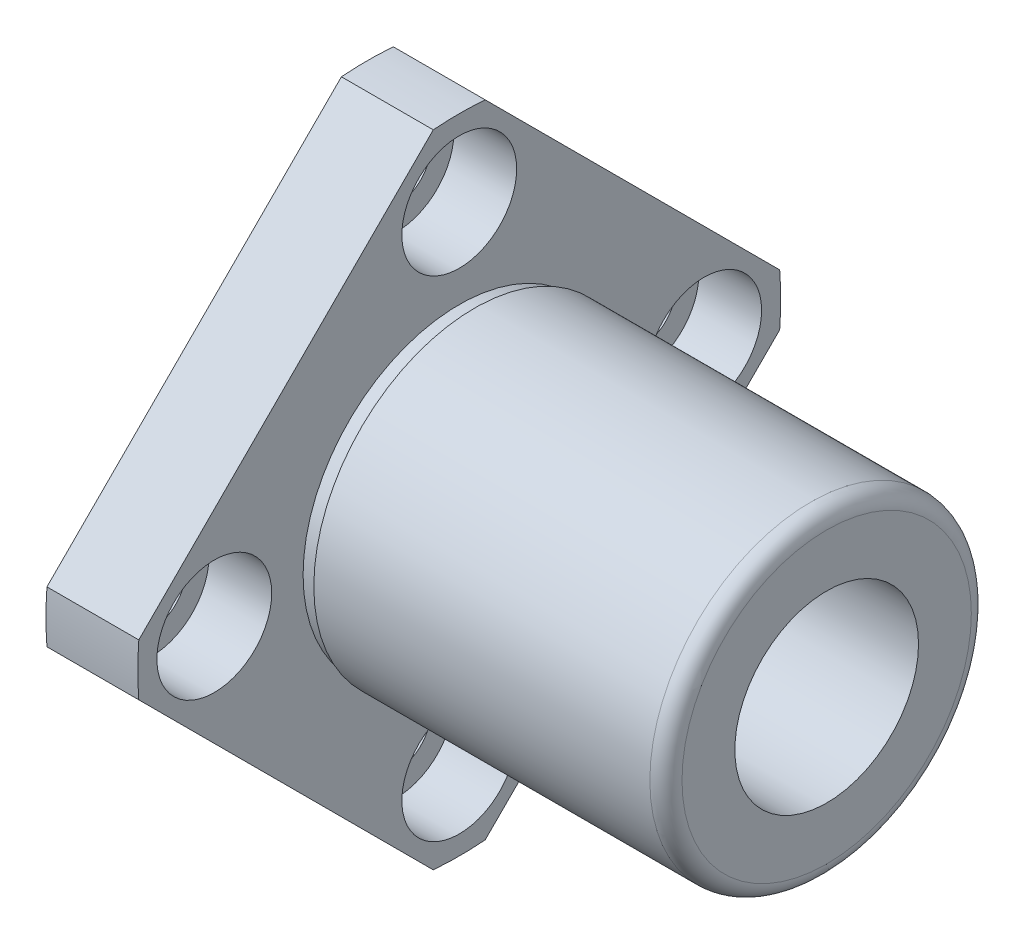
ISO-10303-21;
HEADER;
FILE_DESCRIPTION(('STEP AP214'),'2;1');
FILE_NAME('part.step','',(''),(''),'','','');
FILE_SCHEMA(('AUTOMOTIVE_DESIGN { 1 0 10303 214 1 1 1 1 }'));
ENDSEC;
DATA;
#1=APPLICATION_CONTEXT('core data for automotive mechanical design processes');
#2=APPLICATION_PROTOCOL_DEFINITION('international standard','automotive_design',2000,#1);
#3=PRODUCT_CONTEXT('',#1,'mechanical');
#4=PRODUCT('Part','Part','',(#3));
#5=PRODUCT_RELATED_PRODUCT_CATEGORY('part','',(#4));
#6=PRODUCT_DEFINITION_FORMATION('','',#4);
#7=PRODUCT_DEFINITION_CONTEXT('part definition',#1,'design');
#8=PRODUCT_DEFINITION('design','',#6,#7);
#9=PRODUCT_DEFINITION_SHAPE('','',#8);
#10=(LENGTH_UNIT() NAMED_UNIT(*) SI_UNIT(.MILLI.,.METRE.));
#11=(NAMED_UNIT(*) PLANE_ANGLE_UNIT() SI_UNIT($,.RADIAN.));
#12=(NAMED_UNIT(*) SI_UNIT($,.STERADIAN.) SOLID_ANGLE_UNIT());
#13=UNCERTAINTY_MEASURE_WITH_UNIT(LENGTH_MEASURE(1.E-05),#10,'distance_accuracy_value','');
#14=(GEOMETRIC_REPRESENTATION_CONTEXT(3) GLOBAL_UNCERTAINTY_ASSIGNED_CONTEXT((#13)) GLOBAL_UNIT_ASSIGNED_CONTEXT((#10,
#11,#12)) REPRESENTATION_CONTEXT('',''));
#15=CARTESIAN_POINT('',(0.,0.,0.));
#16=DIRECTION('',(0.,0.,1.));
#17=DIRECTION('',(1.,0.,0.));
#18=AXIS2_PLACEMENT_3D('',#15,#16,#17);
#19=CARTESIAN_POINT('',(0.,0.,0.));
#20=DIRECTION('',(-1.,0.,0.));
#21=DIRECTION('',(0.,0.,1.));
#22=AXIS2_PLACEMENT_3D('',#19,#20,#21);
#23=PLANE('',#22);
#24=CARTESIAN_POINT('',(0.,0.,0.));
#25=DIRECTION('',(1.,0.,0.));
#26=DIRECTION('',(0.,0.,-1.));
#27=AXIS2_PLACEMENT_3D('',#24,#25,#26);
#28=CIRCLE('',#27,5.99999999999998);
#29=CARTESIAN_POINT('',(0.,0.,-5.99999999999998));
#30=VERTEX_POINT('',#29);
#31=EDGE_CURVE('E257',#30,#30,#28,.T.);
#32=ORIENTED_EDGE('',*,*,#31,.T.);
#33=EDGE_LOOP('',(#32));
#34=FACE_BOUND('',#33,.T.);
#35=CARTESIAN_POINT('',(0.,-16.,0.));
#36=DIRECTION('',(1.,0.,0.));
#37=DIRECTION('',(0.,0.,-1.));
#38=AXIS2_PLACEMENT_3D('',#35,#36,#37);
#39=CIRCLE('',#38,2.25000000000001);
#40=CARTESIAN_POINT('',(0.,-16.,-2.25000000000001));
#41=VERTEX_POINT('',#40);
#42=EDGE_CURVE('E273',#41,#41,#39,.T.);
#43=ORIENTED_EDGE('',*,*,#42,.T.);
#44=EDGE_LOOP('',(#43));
#45=FACE_BOUND('',#44,.T.);
#46=CARTESIAN_POINT('',(0.,0.,-16.));
#47=DIRECTION('',(1.,0.,0.));
#48=DIRECTION('',(0.,0.,-1.));
#49=AXIS2_PLACEMENT_3D('',#46,#47,#48);
#50=CIRCLE('',#49,2.25000000000001);
#51=CARTESIAN_POINT('',(0.,0.,-18.25));
#52=VERTEX_POINT('',#51);
#53=EDGE_CURVE('E285',#52,#52,#50,.T.);
#54=ORIENTED_EDGE('',*,*,#53,.T.);
#55=EDGE_LOOP('',(#54));
#56=FACE_BOUND('',#55,.T.);
#57=CARTESIAN_POINT('',(0.,0.,16.));
#58=DIRECTION('',(1.,0.,0.));
#59=DIRECTION('',(0.,0.,-1.));
#60=AXIS2_PLACEMENT_3D('',#57,#58,#59);
#61=CIRCLE('',#60,2.25000000000001);
#62=CARTESIAN_POINT('',(0.,0.,13.75));
#63=VERTEX_POINT('',#62);
#64=EDGE_CURVE('E297',#63,#63,#61,.T.);
#65=ORIENTED_EDGE('',*,*,#64,.T.);
#66=EDGE_LOOP('',(#65));
#67=FACE_BOUND('',#66,.T.);
#68=CARTESIAN_POINT('',(0.,0.,0.));
#69=DIRECTION('',(-1.,0.,0.));
#70=DIRECTION('',(0.,0.,1.));
#71=AXIS2_PLACEMENT_3D('',#68,#69,#70);
#72=CIRCLE('',#71,21.);
#73=CARTESIAN_POINT('',(0.,-1.69601646814907,20.9314005298204));
#74=VERTEX_POINT('',#73);
#75=CARTESIAN_POINT('',(0.,1.69601646814907,20.9314005298204));
#76=VERTEX_POINT('',#75);
#77=EDGE_CURVE('E130',#74,#76,#72,.T.);
#78=ORIENTED_EDGE('',*,*,#77,.T.);
#79=DIRECTION('',(0.,0.707106781186547,-0.707106781186547));
#80=VECTOR('',#79,1.);
#81=CARTESIAN_POINT('',(0.,1.69601646814907,20.9314005298204));
#82=LINE('',#81,#80);
#83=CARTESIAN_POINT('',(0.,20.9314005298204,1.69601646814907));
#84=VERTEX_POINT('',#83);
#85=EDGE_CURVE('E133',#76,#84,#82,.T.);
#86=ORIENTED_EDGE('',*,*,#85,.T.);
#87=CARTESIAN_POINT('',(0.,0.,0.));
#88=DIRECTION('',(-1.,0.,0.));
#89=DIRECTION('',(0.,0.,1.));
#90=AXIS2_PLACEMENT_3D('',#87,#88,#89);
#91=CIRCLE('',#90,21.);
#92=CARTESIAN_POINT('',(0.,20.9314005298204,-1.69601646814907));
#93=VERTEX_POINT('',#92);
#94=EDGE_CURVE('E137',#84,#93,#91,.T.);
#95=ORIENTED_EDGE('',*,*,#94,.T.);
#96=DIRECTION('',(0.,-0.707106781186548,-0.707106781186547));
#97=VECTOR('',#96,1.);
#98=CARTESIAN_POINT('',(0.,20.9314005298204,-1.69601646814907));
#99=LINE('',#98,#97);
#100=CARTESIAN_POINT('',(0.,1.69601646814906,-20.9314005298204));
#101=VERTEX_POINT('',#100);
#102=EDGE_CURVE('E140',#93,#101,#99,.T.);
#103=ORIENTED_EDGE('',*,*,#102,.T.);
#104=CARTESIAN_POINT('',(0.,0.,0.));
#105=DIRECTION('',(-1.,0.,0.));
#106=DIRECTION('',(0.,0.,1.));
#107=AXIS2_PLACEMENT_3D('',#104,#105,#106);
#108=CIRCLE('',#107,21.);
#109=CARTESIAN_POINT('',(0.,-1.69601646814907,-20.9314005298204));
#110=VERTEX_POINT('',#109);
#111=EDGE_CURVE('E143',#101,#110,#108,.T.);
#112=ORIENTED_EDGE('',*,*,#111,.T.);
#113=DIRECTION('',(0.,-0.707106781186547,0.707106781186548));
#114=VECTOR('',#113,1.);
#115=CARTESIAN_POINT('',(0.,-1.69601646814907,-20.9314005298204));
#116=LINE('',#115,#114);
#117=CARTESIAN_POINT('',(0.,-20.9314005298204,-1.69601646814908));
#118=VERTEX_POINT('',#117);
#119=EDGE_CURVE('E146',#110,#118,#116,.T.);
#120=ORIENTED_EDGE('',*,*,#119,.T.);
#121=CARTESIAN_POINT('',(0.,0.,0.));
#122=DIRECTION('',(-1.,0.,0.));
#123=DIRECTION('',(0.,0.,1.));
#124=AXIS2_PLACEMENT_3D('',#121,#122,#123);
#125=CIRCLE('',#124,21.);
#126=CARTESIAN_POINT('',(0.,-20.9314005298204,1.69601646814908));
#127=VERTEX_POINT('',#126);
#128=EDGE_CURVE('E107',#118,#127,#125,.T.);
#129=ORIENTED_EDGE('',*,*,#128,.T.);
#130=DIRECTION('',(0.,0.707106781186547,0.707106781186547));
#131=VECTOR('',#130,1.);
#132=CARTESIAN_POINT('',(0.,-20.9314005298204,1.69601646814908));
#133=LINE('',#132,#131);
#134=EDGE_CURVE('E149',#127,#74,#133,.T.);
#135=ORIENTED_EDGE('',*,*,#134,.T.);
#136=EDGE_LOOP('',(#78,#86,#95,#103,#112,#120,#129,#135));
#137=FACE_BOUND('',#136,.T.);
#138=CARTESIAN_POINT('',(0.,16.,0.));
#139=DIRECTION('',(1.,0.,0.));
#140=DIRECTION('',(0.,0.,-1.));
#141=AXIS2_PLACEMENT_3D('',#138,#139,#140);
#142=CIRCLE('',#141,2.25000000000001);
#143=CARTESIAN_POINT('',(0.,16.,-2.25000000000001));
#144=VERTEX_POINT('',#143);
#145=EDGE_CURVE('E309',#144,#144,#142,.T.);
#146=ORIENTED_EDGE('',*,*,#145,.T.);
#147=EDGE_LOOP('',(#146));
#148=FACE_BOUND('',#147,.T.);
#149=ADVANCED_FACE('F32',(#34,#45,#56,#67,#137,#148),#23,.T.);
#150=CARTESIAN_POINT('',(6.,0.,0.));
#151=DIRECTION('',(-1.,0.,0.));
#152=DIRECTION('',(0.,0.,1.));
#153=AXIS2_PLACEMENT_3D('',#150,#151,#152);
#154=CYLINDRICAL_SURFACE('',#153,21.);
#155=ORIENTED_EDGE('',*,*,#77,.F.);
#156=DIRECTION('',(-1.,0.,0.));
#157=VECTOR('',#156,1.);
#158=CARTESIAN_POINT('',(6.,-1.69601646814907,20.9314005298204));
#159=LINE('',#158,#157);
#160=CARTESIAN_POINT('',(6.,-1.69601646814907,20.9314005298204));
#161=VERTEX_POINT('',#160);
#162=EDGE_CURVE('E11',#161,#74,#159,.T.);
#163=ORIENTED_EDGE('',*,*,#162,.F.);
#164=CARTESIAN_POINT('',(6.,0.,0.));
#165=DIRECTION('',(-1.,0.,0.));
#166=DIRECTION('',(0.,0.,1.));
#167=AXIS2_PLACEMENT_3D('',#164,#165,#166);
#168=CIRCLE('',#167,21.);
#169=CARTESIAN_POINT('',(6.,1.69601646814907,20.9314005298204));
#170=VERTEX_POINT('',#169);
#171=EDGE_CURVE('E151',#161,#170,#168,.T.);
#172=ORIENTED_EDGE('',*,*,#171,.T.);
#173=DIRECTION('',(-1.,0.,0.));
#174=VECTOR('',#173,1.);
#175=CARTESIAN_POINT('',(6.,1.69601646814907,20.9314005298204));
#176=LINE('',#175,#174);
#177=EDGE_CURVE('E36',#170,#76,#176,.T.);
#178=ORIENTED_EDGE('',*,*,#177,.T.);
#179=EDGE_LOOP('',(#155,#163,#172,#178));
#180=FACE_BOUND('',#179,.T.);
#181=ADVANCED_FACE('F34',(#180),#154,.T.);
#182=CARTESIAN_POINT('',(6.,-20.9314005298204,1.69601646814908));
#183=DIRECTION('',(0.,-0.707106781186547,0.707106781186548));
#184=DIRECTION('',(0.,-0.707106781186548,-0.707106781186547));
#185=AXIS2_PLACEMENT_3D('',#182,#183,#184);
#186=PLANE('',#185);
#187=ORIENTED_EDGE('',*,*,#134,.F.);
#188=DIRECTION('',(-1.,0.,0.));
#189=VECTOR('',#188,1.);
#190=CARTESIAN_POINT('',(6.,-20.9314005298204,1.69601646814908));
#191=LINE('',#190,#189);
#192=CARTESIAN_POINT('',(6.,-20.9314005298204,1.69601646814908));
#193=VERTEX_POINT('',#192);
#194=EDGE_CURVE('E42',#193,#127,#191,.T.);
#195=ORIENTED_EDGE('',*,*,#194,.F.);
#196=DIRECTION('',(0.,0.707106781186547,0.707106781186547));
#197=VECTOR('',#196,1.);
#198=CARTESIAN_POINT('',(6.,-20.9314005298204,1.69601646814908));
#199=LINE('',#198,#197);
#200=EDGE_CURVE('E120',#193,#161,#199,.T.);
#201=ORIENTED_EDGE('',*,*,#200,.T.);
#202=ORIENTED_EDGE('',*,*,#162,.T.);
#203=EDGE_LOOP('',(#187,#195,#201,#202));
#204=FACE_BOUND('',#203,.T.);
#205=ADVANCED_FACE('F163',(#204),#186,.T.);
#206=CARTESIAN_POINT('',(6.,0.,0.));
#207=DIRECTION('',(-1.,0.,0.));
#208=DIRECTION('',(0.,0.,1.));
#209=AXIS2_PLACEMENT_3D('',#206,#207,#208);
#210=CYLINDRICAL_SURFACE('',#209,21.);
#211=ORIENTED_EDGE('',*,*,#128,.F.);
#212=DIRECTION('',(-1.,0.,0.));
#213=VECTOR('',#212,1.);
#214=CARTESIAN_POINT('',(6.,-20.9314005298204,-1.69601646814908));
#215=LINE('',#214,#213);
#216=CARTESIAN_POINT('',(6.,-20.9314005298204,-1.69601646814908));
#217=VERTEX_POINT('',#216);
#218=EDGE_CURVE('E102',#217,#118,#215,.T.);
#219=ORIENTED_EDGE('',*,*,#218,.F.);
#220=CARTESIAN_POINT('',(6.,0.,0.));
#221=DIRECTION('',(-1.,0.,0.));
#222=DIRECTION('',(0.,0.,1.));
#223=AXIS2_PLACEMENT_3D('',#220,#221,#222);
#224=CIRCLE('',#223,21.);
#225=EDGE_CURVE('E105',#217,#193,#224,.T.);
#226=ORIENTED_EDGE('',*,*,#225,.T.);
#227=ORIENTED_EDGE('',*,*,#194,.T.);
#228=EDGE_LOOP('',(#211,#219,#226,#227));
#229=FACE_BOUND('',#228,.T.);
#230=ADVANCED_FACE('F104',(#229),#210,.T.);
#231=CARTESIAN_POINT('',(6.,-1.69601646814907,-20.9314005298204));
#232=DIRECTION('',(0.,-0.707106781186548,-0.707106781186547));
#233=DIRECTION('',(0.,0.707106781186547,-0.707106781186548));
#234=AXIS2_PLACEMENT_3D('',#231,#232,#233);
#235=PLANE('',#234);
#236=ORIENTED_EDGE('',*,*,#119,.F.);
#237=DIRECTION('',(-1.,0.,0.));
#238=VECTOR('',#237,1.);
#239=CARTESIAN_POINT('',(6.,-1.69601646814907,-20.9314005298204));
#240=LINE('',#239,#238);
#241=CARTESIAN_POINT('',(6.,-1.69601646814907,-20.9314005298204));
#242=VERTEX_POINT('',#241);
#243=EDGE_CURVE('E112',#242,#110,#240,.T.);
#244=ORIENTED_EDGE('',*,*,#243,.F.);
#245=DIRECTION('',(0.,-0.707106781186547,0.707106781186548));
#246=VECTOR('',#245,1.);
#247=CARTESIAN_POINT('',(6.,-1.69601646814907,-20.9314005298204));
#248=LINE('',#247,#246);
#249=EDGE_CURVE('E118',#242,#217,#248,.T.);
#250=ORIENTED_EDGE('',*,*,#249,.T.);
#251=ORIENTED_EDGE('',*,*,#218,.T.);
#252=EDGE_LOOP('',(#236,#244,#250,#251));
#253=FACE_BOUND('',#252,.T.);
#254=ADVANCED_FACE('F122',(#253),#235,.T.);
#255=CARTESIAN_POINT('',(6.,0.,0.));
#256=DIRECTION('',(-1.,0.,0.));
#257=DIRECTION('',(0.,0.,1.));
#258=AXIS2_PLACEMENT_3D('',#255,#256,#257);
#259=CYLINDRICAL_SURFACE('',#258,21.);
#260=ORIENTED_EDGE('',*,*,#111,.F.);
#261=DIRECTION('',(-1.,0.,0.));
#262=VECTOR('',#261,1.);
#263=CARTESIAN_POINT('',(6.,1.69601646814906,-20.9314005298204));
#264=LINE('',#263,#262);
#265=CARTESIAN_POINT('',(6.,1.69601646814906,-20.9314005298204));
#266=VERTEX_POINT('',#265);
#267=EDGE_CURVE('E155',#266,#101,#264,.T.);
#268=ORIENTED_EDGE('',*,*,#267,.F.);
#269=CARTESIAN_POINT('',(6.,0.,0.));
#270=DIRECTION('',(-1.,0.,0.));
#271=DIRECTION('',(0.,0.,1.));
#272=AXIS2_PLACEMENT_3D('',#269,#270,#271);
#273=CIRCLE('',#272,21.);
#274=EDGE_CURVE('E123',#266,#242,#273,.T.);
#275=ORIENTED_EDGE('',*,*,#274,.T.);
#276=ORIENTED_EDGE('',*,*,#243,.T.);
#277=EDGE_LOOP('',(#260,#268,#275,#276));
#278=FACE_BOUND('',#277,.T.);
#279=ADVANCED_FACE('F341',(#278),#259,.T.);
#280=CARTESIAN_POINT('',(6.,20.9314005298204,-1.69601646814907));
#281=DIRECTION('',(0.,0.707106781186547,-0.707106781186548));
#282=DIRECTION('',(0.,0.707106781186548,0.707106781186547));
#283=AXIS2_PLACEMENT_3D('',#280,#281,#282);
#284=PLANE('',#283);
#285=ORIENTED_EDGE('',*,*,#102,.F.);
#286=DIRECTION('',(-1.,0.,0.));
#287=VECTOR('',#286,1.);
#288=CARTESIAN_POINT('',(6.,20.9314005298204,-1.69601646814907));
#289=LINE('',#288,#287);
#290=CARTESIAN_POINT('',(6.,20.9314005298204,-1.69601646814907));
#291=VERTEX_POINT('',#290);
#292=EDGE_CURVE('E157',#291,#93,#289,.T.);
#293=ORIENTED_EDGE('',*,*,#292,.F.);
#294=DIRECTION('',(0.,-0.707106781186548,-0.707106781186547));
#295=VECTOR('',#294,1.);
#296=CARTESIAN_POINT('',(6.,20.9314005298204,-1.69601646814907));
#297=LINE('',#296,#295);
#298=EDGE_CURVE('E125',#291,#266,#297,.T.);
#299=ORIENTED_EDGE('',*,*,#298,.T.);
#300=ORIENTED_EDGE('',*,*,#267,.T.);
#301=EDGE_LOOP('',(#285,#293,#299,#300));
#302=FACE_BOUND('',#301,.T.);
#303=ADVANCED_FACE('F335',(#302),#284,.T.);
#304=CARTESIAN_POINT('',(6.,0.,0.));
#305=DIRECTION('',(-1.,0.,0.));
#306=DIRECTION('',(0.,0.,1.));
#307=AXIS2_PLACEMENT_3D('',#304,#305,#306);
#308=CYLINDRICAL_SURFACE('',#307,21.);
#309=ORIENTED_EDGE('',*,*,#94,.F.);
#310=DIRECTION('',(-1.,0.,0.));
#311=VECTOR('',#310,1.);
#312=CARTESIAN_POINT('',(6.,20.9314005298204,1.69601646814907));
#313=LINE('',#312,#311);
#314=CARTESIAN_POINT('',(6.,20.9314005298204,1.69601646814907));
#315=VERTEX_POINT('',#314);
#316=EDGE_CURVE('E158',#315,#84,#313,.T.);
#317=ORIENTED_EDGE('',*,*,#316,.F.);
#318=CARTESIAN_POINT('',(6.,0.,0.));
#319=DIRECTION('',(-1.,0.,0.));
#320=DIRECTION('',(0.,0.,1.));
#321=AXIS2_PLACEMENT_3D('',#318,#319,#320);
#322=CIRCLE('',#321,21.);
#323=EDGE_CURVE('E329',#315,#291,#322,.T.);
#324=ORIENTED_EDGE('',*,*,#323,.T.);
#325=ORIENTED_EDGE('',*,*,#292,.T.);
#326=EDGE_LOOP('',(#309,#317,#324,#325));
#327=FACE_BOUND('',#326,.T.);
#328=ADVANCED_FACE('F339',(#327),#308,.T.);
#329=CARTESIAN_POINT('',(6.,1.69601646814907,20.9314005298204));
#330=DIRECTION('',(0.,0.707106781186548,0.707106781186547));
#331=DIRECTION('',(0.,-0.707106781186547,0.707106781186548));
#332=AXIS2_PLACEMENT_3D('',#329,#330,#331);
#333=PLANE('',#332);
#334=ORIENTED_EDGE('',*,*,#85,.F.);
#335=ORIENTED_EDGE('',*,*,#177,.F.);
#336=DIRECTION('',(0.,0.707106781186547,-0.707106781186547));
#337=VECTOR('',#336,1.);
#338=CARTESIAN_POINT('',(6.,1.69601646814907,20.9314005298204));
#339=LINE('',#338,#337);
#340=EDGE_CURVE('E327',#170,#315,#339,.T.);
#341=ORIENTED_EDGE('',*,*,#340,.T.);
#342=ORIENTED_EDGE('',*,*,#316,.T.);
#343=EDGE_LOOP('',(#334,#335,#341,#342));
#344=FACE_BOUND('',#343,.T.);
#345=ADVANCED_FACE('F160',(#344),#333,.T.);
#346=CARTESIAN_POINT('',(6.,0.,0.));
#347=DIRECTION('',(-1.,0.,0.));
#348=DIRECTION('',(0.,0.,1.));
#349=AXIS2_PLACEMENT_3D('',#346,#347,#348);
#350=PLANE('',#349);
#351=CARTESIAN_POINT('',(6.,-16.,0.));
#352=DIRECTION('',(1.,0.,0.));
#353=DIRECTION('',(0.,0.,-1.));
#354=AXIS2_PLACEMENT_3D('',#351,#352,#353);
#355=CIRCLE('',#354,3.74999999999999);
#356=CARTESIAN_POINT('',(6.,-16.,-3.74999999999999));
#357=VERTEX_POINT('',#356);
#358=EDGE_CURVE('E262',#357,#357,#355,.T.);
#359=ORIENTED_EDGE('',*,*,#358,.F.);
#360=EDGE_LOOP('',(#359));
#361=FACE_BOUND('',#360,.T.);
#362=CARTESIAN_POINT('',(6.,0.,-16.));
#363=DIRECTION('',(1.,0.,0.));
#364=DIRECTION('',(0.,0.,-1.));
#365=AXIS2_PLACEMENT_3D('',#362,#363,#364);
#366=CIRCLE('',#365,3.74999999999999);
#367=CARTESIAN_POINT('',(6.,0.,-19.75));
#368=VERTEX_POINT('',#367);
#369=EDGE_CURVE('E276',#368,#368,#366,.T.);
#370=ORIENTED_EDGE('',*,*,#369,.F.);
#371=EDGE_LOOP('',(#370));
#372=FACE_BOUND('',#371,.T.);
#373=CARTESIAN_POINT('',(6.,0.,16.));
#374=DIRECTION('',(1.,0.,0.));
#375=DIRECTION('',(0.,0.,-1.));
#376=AXIS2_PLACEMENT_3D('',#373,#374,#375);
#377=CIRCLE('',#376,3.74999999999999);
#378=CARTESIAN_POINT('',(6.,0.,12.25));
#379=VERTEX_POINT('',#378);
#380=EDGE_CURVE('E288',#379,#379,#377,.T.);
#381=ORIENTED_EDGE('',*,*,#380,.F.);
#382=EDGE_LOOP('',(#381));
#383=FACE_BOUND('',#382,.T.);
#384=CARTESIAN_POINT('',(6.,16.,0.));
#385=DIRECTION('',(1.,0.,0.));
#386=DIRECTION('',(0.,0.,-1.));
#387=AXIS2_PLACEMENT_3D('',#384,#385,#386);
#388=CIRCLE('',#387,3.74999999999999);
#389=CARTESIAN_POINT('',(6.,16.,-3.74999999999999));
#390=VERTEX_POINT('',#389);
#391=EDGE_CURVE('E300',#390,#390,#388,.T.);
#392=ORIENTED_EDGE('',*,*,#391,.F.);
#393=EDGE_LOOP('',(#392));
#394=FACE_BOUND('',#393,.T.);
#395=CARTESIAN_POINT('',(6.,0.,0.));
#396=DIRECTION('',(-1.,0.,0.));
#397=DIRECTION('',(0.,0.,1.));
#398=AXIS2_PLACEMENT_3D('',#395,#396,#397);
#399=CIRCLE('',#398,10.2);
#400=CARTESIAN_POINT('',(6.,0.,10.2));
#401=VERTEX_POINT('',#400);
#402=EDGE_CURVE('E321',#401,#401,#399,.T.);
#403=ORIENTED_EDGE('',*,*,#402,.T.);
#404=EDGE_LOOP('',(#403));
#405=FACE_BOUND('',#404,.T.);
#406=ORIENTED_EDGE('',*,*,#171,.F.);
#407=ORIENTED_EDGE('',*,*,#200,.F.);
#408=ORIENTED_EDGE('',*,*,#225,.F.);
#409=ORIENTED_EDGE('',*,*,#249,.F.);
#410=ORIENTED_EDGE('',*,*,#274,.F.);
#411=ORIENTED_EDGE('',*,*,#298,.F.);
#412=ORIENTED_EDGE('',*,*,#323,.F.);
#413=ORIENTED_EDGE('',*,*,#340,.F.);
#414=EDGE_LOOP('',(#406,#407,#408,#409,#410,#411,#412,#413));
#415=FACE_BOUND('',#414,.T.);
#416=ADVANCED_FACE('F116',(#361,#372,#383,#394,#405,#415),#350,.F.);
#417=CARTESIAN_POINT('',(28.95,0.,0.));
#418=DIRECTION('',(-1.,0.,0.));
#419=DIRECTION('',(0.,0.,1.));
#420=AXIS2_PLACEMENT_3D('',#417,#418,#419);
#421=TOROIDAL_SURFACE('',#420,9.45,1.05);
#422=CARTESIAN_POINT('',(30.,0.,0.));
#423=DIRECTION('',(-1.,0.,0.));
#424=DIRECTION('',(0.,0.,1.));
#425=AXIS2_PLACEMENT_3D('',#422,#423,#424);
#426=CIRCLE('',#425,9.45);
#427=CARTESIAN_POINT('',(30.,0.,9.45));
#428=VERTEX_POINT('',#427);
#429=EDGE_CURVE('E134',#428,#428,#426,.T.);
#430=ORIENTED_EDGE('',*,*,#429,.T.);
#431=EDGE_LOOP('',(#430));
#432=FACE_BOUND('',#431,.T.);
#433=CARTESIAN_POINT('',(28.95,0.,0.));
#434=DIRECTION('',(-1.,0.,0.));
#435=DIRECTION('',(0.,0.,1.));
#436=AXIS2_PLACEMENT_3D('',#433,#434,#435);
#437=CIRCLE('',#436,10.5);
#438=CARTESIAN_POINT('',(28.95,0.,10.5));
#439=VERTEX_POINT('',#438);
#440=EDGE_CURVE('E312',#439,#439,#437,.T.);
#441=ORIENTED_EDGE('',*,*,#440,.F.);
#442=EDGE_LOOP('',(#441));
#443=FACE_BOUND('',#442,.T.);
#444=ADVANCED_FACE('F181',(#432,#443),#421,.T.);
#445=CARTESIAN_POINT('',(30.,9.45,0.));
#446=DIRECTION('',(1.,0.,0.));
#447=DIRECTION('',(0.,0.,-1.));
#448=AXIS2_PLACEMENT_3D('',#445,#446,#447);
#449=PLANE('',#448);
#450=CARTESIAN_POINT('',(30.,0.,0.));
#451=DIRECTION('',(1.,0.,0.));
#452=DIRECTION('',(0.,0.,-1.));
#453=AXIS2_PLACEMENT_3D('',#450,#451,#452);
#454=CIRCLE('',#453,5.99999999999999);
#455=CARTESIAN_POINT('',(30.,0.,-5.99999999999999));
#456=VERTEX_POINT('',#455);
#457=EDGE_CURVE('E260',#456,#456,#454,.T.);
#458=ORIENTED_EDGE('',*,*,#457,.F.);
#459=EDGE_LOOP('',(#458));
#460=FACE_BOUND('',#459,.T.);
#461=ORIENTED_EDGE('',*,*,#429,.F.);
#462=EDGE_LOOP('',(#461));
#463=FACE_BOUND('',#462,.T.);
#464=ADVANCED_FACE('F185',(#460,#463),#449,.T.);
#465=CARTESIAN_POINT('',(30.00125,0.,0.));
#466=DIRECTION('',(-1.,0.,0.));
#467=DIRECTION('',(0.,0.,1.));
#468=AXIS2_PLACEMENT_3D('',#465,#466,#467);
#469=CYLINDRICAL_SURFACE('',#468,10.2);
#470=CARTESIAN_POINT('',(7.,0.,0.));
#471=DIRECTION('',(-1.,0.,0.));
#472=DIRECTION('',(0.,0.,1.));
#473=AXIS2_PLACEMENT_3D('',#470,#471,#472);
#474=CIRCLE('',#473,10.2);
#475=CARTESIAN_POINT('',(7.,0.,10.2));
#476=VERTEX_POINT('',#475);
#477=EDGE_CURVE('E318',#476,#476,#474,.T.);
#478=ORIENTED_EDGE('',*,*,#477,.T.);
#479=EDGE_LOOP('',(#478));
#480=FACE_BOUND('',#479,.T.);
#481=ORIENTED_EDGE('',*,*,#402,.F.);
#482=EDGE_LOOP('',(#481));
#483=FACE_BOUND('',#482,.T.);
#484=ADVANCED_FACE('F189',(#480,#483),#469,.T.);
#485=CARTESIAN_POINT('',(7.,10.2,0.));
#486=DIRECTION('',(-1.,0.,0.));
#487=DIRECTION('',(0.,0.,1.));
#488=AXIS2_PLACEMENT_3D('',#485,#486,#487);
#489=PLANE('',#488);
#490=CARTESIAN_POINT('',(7.,0.,0.));
#491=DIRECTION('',(-1.,0.,0.));
#492=DIRECTION('',(0.,0.,1.));
#493=AXIS2_PLACEMENT_3D('',#490,#491,#492);
#494=CIRCLE('',#493,10.5);
#495=CARTESIAN_POINT('',(7.,0.,10.5));
#496=VERTEX_POINT('',#495);
#497=EDGE_CURVE('E315',#496,#496,#494,.T.);
#498=ORIENTED_EDGE('',*,*,#497,.T.);
#499=EDGE_LOOP('',(#498));
#500=FACE_BOUND('',#499,.T.);
#501=ORIENTED_EDGE('',*,*,#477,.F.);
#502=EDGE_LOOP('',(#501));
#503=FACE_BOUND('',#502,.T.);
#504=ADVANCED_FACE('F193',(#500,#503),#489,.T.);
#505=CARTESIAN_POINT('',(30.00125,0.,0.));
#506=DIRECTION('',(-1.,0.,0.));
#507=DIRECTION('',(0.,0.,1.));
#508=AXIS2_PLACEMENT_3D('',#505,#506,#507);
#509=CYLINDRICAL_SURFACE('',#508,10.5);
#510=ORIENTED_EDGE('',*,*,#440,.T.);
#511=EDGE_LOOP('',(#510));
#512=FACE_BOUND('',#511,.T.);
#513=ORIENTED_EDGE('',*,*,#497,.F.);
#514=EDGE_LOOP('',(#513));
#515=FACE_BOUND('',#514,.T.);
#516=ADVANCED_FACE('F197',(#512,#515),#509,.T.);
#517=CARTESIAN_POINT('',(6.,16.,0.));
#518=DIRECTION('',(1.,0.,0.));
#519=DIRECTION('',(0.,0.,-1.));
#520=AXIS2_PLACEMENT_3D('',#517,#518,#519);
#521=CYLINDRICAL_SURFACE('',#520,2.25000000000001);
#522=ORIENTED_EDGE('',*,*,#145,.F.);
#523=EDGE_LOOP('',(#522));
#524=FACE_BOUND('',#523,.T.);
#525=CARTESIAN_POINT('',(1.9,16.,0.));
#526=DIRECTION('',(1.,0.,0.));
#527=DIRECTION('',(0.,0.,-1.));
#528=AXIS2_PLACEMENT_3D('',#525,#526,#527);
#529=CIRCLE('',#528,2.25000000000001);
#530=CARTESIAN_POINT('',(1.9,16.,-2.25000000000001));
#531=VERTEX_POINT('',#530);
#532=EDGE_CURVE('E306',#531,#531,#529,.T.);
#533=ORIENTED_EDGE('',*,*,#532,.T.);
#534=EDGE_LOOP('',(#533));
#535=FACE_BOUND('',#534,.T.);
#536=ADVANCED_FACE('F201',(#524,#535),#521,.F.);
#537=CARTESIAN_POINT('',(1.9,18.25,0.));
#538=DIRECTION('',(-1.,0.,0.));
#539=DIRECTION('',(0.,0.,1.));
#540=AXIS2_PLACEMENT_3D('',#537,#538,#539);
#541=PLANE('',#540);
#542=ORIENTED_EDGE('',*,*,#532,.F.);
#543=EDGE_LOOP('',(#542));
#544=FACE_BOUND('',#543,.T.);
#545=CARTESIAN_POINT('',(1.9,16.,0.));
#546=DIRECTION('',(1.,0.,0.));
#547=DIRECTION('',(0.,0.,-1.));
#548=AXIS2_PLACEMENT_3D('',#545,#546,#547);
#549=CIRCLE('',#548,3.74999999999999);
#550=CARTESIAN_POINT('',(1.9,16.,-3.74999999999999));
#551=VERTEX_POINT('',#550);
#552=EDGE_CURVE('E303',#551,#551,#549,.T.);
#553=ORIENTED_EDGE('',*,*,#552,.T.);
#554=EDGE_LOOP('',(#553));
#555=FACE_BOUND('',#554,.T.);
#556=ADVANCED_FACE('F205',(#544,#555),#541,.F.);
#557=CARTESIAN_POINT('',(6.,16.,0.));
#558=DIRECTION('',(1.,0.,0.));
#559=DIRECTION('',(0.,0.,-1.));
#560=AXIS2_PLACEMENT_3D('',#557,#558,#559);
#561=CYLINDRICAL_SURFACE('',#560,3.74999999999999);
#562=ORIENTED_EDGE('',*,*,#552,.F.);
#563=EDGE_LOOP('',(#562));
#564=FACE_BOUND('',#563,.T.);
#565=ORIENTED_EDGE('',*,*,#391,.T.);
#566=EDGE_LOOP('',(#565));
#567=FACE_BOUND('',#566,.T.);
#568=ADVANCED_FACE('F209',(#564,#567),#561,.F.);
#569=CARTESIAN_POINT('',(6.,0.,16.));
#570=DIRECTION('',(1.,0.,0.));
#571=DIRECTION('',(0.,0.,-1.));
#572=AXIS2_PLACEMENT_3D('',#569,#570,#571);
#573=CYLINDRICAL_SURFACE('',#572,2.25000000000001);
#574=ORIENTED_EDGE('',*,*,#64,.F.);
#575=EDGE_LOOP('',(#574));
#576=FACE_BOUND('',#575,.T.);
#577=CARTESIAN_POINT('',(1.9,0.,16.));
#578=DIRECTION('',(1.,0.,0.));
#579=DIRECTION('',(0.,0.,-1.));
#580=AXIS2_PLACEMENT_3D('',#577,#578,#579);
#581=CIRCLE('',#580,2.25000000000001);
#582=CARTESIAN_POINT('',(1.9,0.,13.75));
#583=VERTEX_POINT('',#582);
#584=EDGE_CURVE('E294',#583,#583,#581,.T.);
#585=ORIENTED_EDGE('',*,*,#584,.T.);
#586=EDGE_LOOP('',(#585));
#587=FACE_BOUND('',#586,.T.);
#588=ADVANCED_FACE('F213',(#576,#587),#573,.F.);
#589=CARTESIAN_POINT('',(1.9,2.25000000000001,16.));
#590=DIRECTION('',(-1.,0.,0.));
#591=DIRECTION('',(0.,0.,1.));
#592=AXIS2_PLACEMENT_3D('',#589,#590,#591);
#593=PLANE('',#592);
#594=ORIENTED_EDGE('',*,*,#584,.F.);
#595=EDGE_LOOP('',(#594));
#596=FACE_BOUND('',#595,.T.);
#597=CARTESIAN_POINT('',(1.9,0.,16.));
#598=DIRECTION('',(1.,0.,0.));
#599=DIRECTION('',(0.,0.,-1.));
#600=AXIS2_PLACEMENT_3D('',#597,#598,#599);
#601=CIRCLE('',#600,3.74999999999999);
#602=CARTESIAN_POINT('',(1.9,0.,12.25));
#603=VERTEX_POINT('',#602);
#604=EDGE_CURVE('E291',#603,#603,#601,.T.);
#605=ORIENTED_EDGE('',*,*,#604,.T.);
#606=EDGE_LOOP('',(#605));
#607=FACE_BOUND('',#606,.T.);
#608=ADVANCED_FACE('F217',(#596,#607),#593,.F.);
#609=CARTESIAN_POINT('',(6.,0.,16.));
#610=DIRECTION('',(1.,0.,0.));
#611=DIRECTION('',(0.,0.,-1.));
#612=AXIS2_PLACEMENT_3D('',#609,#610,#611);
#613=CYLINDRICAL_SURFACE('',#612,3.74999999999999);
#614=ORIENTED_EDGE('',*,*,#604,.F.);
#615=EDGE_LOOP('',(#614));
#616=FACE_BOUND('',#615,.T.);
#617=ORIENTED_EDGE('',*,*,#380,.T.);
#618=EDGE_LOOP('',(#617));
#619=FACE_BOUND('',#618,.T.);
#620=ADVANCED_FACE('F221',(#616,#619),#613,.F.);
#621=CARTESIAN_POINT('',(6.,0.,-16.));
#622=DIRECTION('',(1.,0.,0.));
#623=DIRECTION('',(0.,0.,-1.));
#624=AXIS2_PLACEMENT_3D('',#621,#622,#623);
#625=CYLINDRICAL_SURFACE('',#624,2.25000000000001);
#626=ORIENTED_EDGE('',*,*,#53,.F.);
#627=EDGE_LOOP('',(#626));
#628=FACE_BOUND('',#627,.T.);
#629=CARTESIAN_POINT('',(1.9,0.,-16.));
#630=DIRECTION('',(1.,0.,0.));
#631=DIRECTION('',(0.,0.,-1.));
#632=AXIS2_PLACEMENT_3D('',#629,#630,#631);
#633=CIRCLE('',#632,2.25000000000001);
#634=CARTESIAN_POINT('',(1.9,0.,-18.25));
#635=VERTEX_POINT('',#634);
#636=EDGE_CURVE('E282',#635,#635,#633,.T.);
#637=ORIENTED_EDGE('',*,*,#636,.T.);
#638=EDGE_LOOP('',(#637));
#639=FACE_BOUND('',#638,.T.);
#640=ADVANCED_FACE('F225',(#628,#639),#625,.F.);
#641=CARTESIAN_POINT('',(1.9,2.25000000000001,-16.));
#642=DIRECTION('',(-1.,0.,0.));
#643=DIRECTION('',(0.,0.,1.));
#644=AXIS2_PLACEMENT_3D('',#641,#642,#643);
#645=PLANE('',#644);
#646=ORIENTED_EDGE('',*,*,#636,.F.);
#647=EDGE_LOOP('',(#646));
#648=FACE_BOUND('',#647,.T.);
#649=CARTESIAN_POINT('',(1.9,0.,-16.));
#650=DIRECTION('',(1.,0.,0.));
#651=DIRECTION('',(0.,0.,-1.));
#652=AXIS2_PLACEMENT_3D('',#649,#650,#651);
#653=CIRCLE('',#652,3.74999999999999);
#654=CARTESIAN_POINT('',(1.9,0.,-19.75));
#655=VERTEX_POINT('',#654);
#656=EDGE_CURVE('E279',#655,#655,#653,.T.);
#657=ORIENTED_EDGE('',*,*,#656,.T.);
#658=EDGE_LOOP('',(#657));
#659=FACE_BOUND('',#658,.T.);
#660=ADVANCED_FACE('F229',(#648,#659),#645,.F.);
#661=CARTESIAN_POINT('',(6.,0.,-16.));
#662=DIRECTION('',(1.,0.,0.));
#663=DIRECTION('',(0.,0.,-1.));
#664=AXIS2_PLACEMENT_3D('',#661,#662,#663);
#665=CYLINDRICAL_SURFACE('',#664,3.74999999999999);
#666=ORIENTED_EDGE('',*,*,#656,.F.);
#667=EDGE_LOOP('',(#666));
#668=FACE_BOUND('',#667,.T.);
#669=ORIENTED_EDGE('',*,*,#369,.T.);
#670=EDGE_LOOP('',(#669));
#671=FACE_BOUND('',#670,.T.);
#672=ADVANCED_FACE('F233',(#668,#671),#665,.F.);
#673=CARTESIAN_POINT('',(6.,-16.,0.));
#674=DIRECTION('',(1.,0.,0.));
#675=DIRECTION('',(0.,0.,-1.));
#676=AXIS2_PLACEMENT_3D('',#673,#674,#675);
#677=CYLINDRICAL_SURFACE('',#676,2.25000000000001);
#678=ORIENTED_EDGE('',*,*,#42,.F.);
#679=EDGE_LOOP('',(#678));
#680=FACE_BOUND('',#679,.T.);
#681=CARTESIAN_POINT('',(1.9,-16.,0.));
#682=DIRECTION('',(1.,0.,0.));
#683=DIRECTION('',(0.,0.,-1.));
#684=AXIS2_PLACEMENT_3D('',#681,#682,#683);
#685=CIRCLE('',#684,2.25000000000001);
#686=CARTESIAN_POINT('',(1.9,-16.,-2.25000000000001));
#687=VERTEX_POINT('',#686);
#688=EDGE_CURVE('E270',#687,#687,#685,.T.);
#689=ORIENTED_EDGE('',*,*,#688,.T.);
#690=EDGE_LOOP('',(#689));
#691=FACE_BOUND('',#690,.T.);
#692=ADVANCED_FACE('F237',(#680,#691),#677,.F.);
#693=CARTESIAN_POINT('',(1.9,-13.75,0.));
#694=DIRECTION('',(-1.,0.,0.));
#695=DIRECTION('',(0.,0.,1.));
#696=AXIS2_PLACEMENT_3D('',#693,#694,#695);
#697=PLANE('',#696);
#698=ORIENTED_EDGE('',*,*,#688,.F.);
#699=EDGE_LOOP('',(#698));
#700=FACE_BOUND('',#699,.T.);
#701=CARTESIAN_POINT('',(1.9,-16.,0.));
#702=DIRECTION('',(1.,0.,0.));
#703=DIRECTION('',(0.,0.,-1.));
#704=AXIS2_PLACEMENT_3D('',#701,#702,#703);
#705=CIRCLE('',#704,3.74999999999999);
#706=CARTESIAN_POINT('',(1.9,-16.,-3.74999999999999));
#707=VERTEX_POINT('',#706);
#708=EDGE_CURVE('E267',#707,#707,#705,.T.);
#709=ORIENTED_EDGE('',*,*,#708,.T.);
#710=EDGE_LOOP('',(#709));
#711=FACE_BOUND('',#710,.T.);
#712=ADVANCED_FACE('F241',(#700,#711),#697,.F.);
#713=CARTESIAN_POINT('',(6.,-16.,0.));
#714=DIRECTION('',(1.,0.,0.));
#715=DIRECTION('',(0.,0.,-1.));
#716=AXIS2_PLACEMENT_3D('',#713,#714,#715);
#717=CYLINDRICAL_SURFACE('',#716,3.74999999999999);
#718=ORIENTED_EDGE('',*,*,#708,.F.);
#719=EDGE_LOOP('',(#718));
#720=FACE_BOUND('',#719,.T.);
#721=ORIENTED_EDGE('',*,*,#358,.T.);
#722=EDGE_LOOP('',(#721));
#723=FACE_BOUND('',#722,.T.);
#724=ADVANCED_FACE('F245',(#720,#723),#717,.F.);
#725=CARTESIAN_POINT('',(30.,0.,0.));
#726=DIRECTION('',(1.,0.,0.));
#727=DIRECTION('',(0.,0.,-1.));
#728=AXIS2_PLACEMENT_3D('',#725,#726,#727);
#729=CYLINDRICAL_SURFACE('',#728,5.99999999999999);
#730=ORIENTED_EDGE('',*,*,#31,.F.);
#731=EDGE_LOOP('',(#730));
#732=FACE_BOUND('',#731,.T.);
#733=ORIENTED_EDGE('',*,*,#457,.T.);
#734=EDGE_LOOP('',(#733));
#735=FACE_BOUND('',#734,.T.);
#736=ADVANCED_FACE('F249',(#732,#735),#729,.F.);
#737=CLOSED_SHELL('',(#149,#181,#205,#230,#254,#279,#303,#328,#345,#416,#444,#464,#484,#504,
#516,#536,#556,#568,#588,#608,#620,#640,#660,#672,#692,#712,#724,#736));
#738=MANIFOLD_SOLID_BREP('B2',#737);
#739=ADVANCED_BREP_SHAPE_REPRESENTATION('',(#18,#738),#14);
#740=SHAPE_DEFINITION_REPRESENTATION(#9,#739);
ENDSEC;
END-ISO-10303-21;
